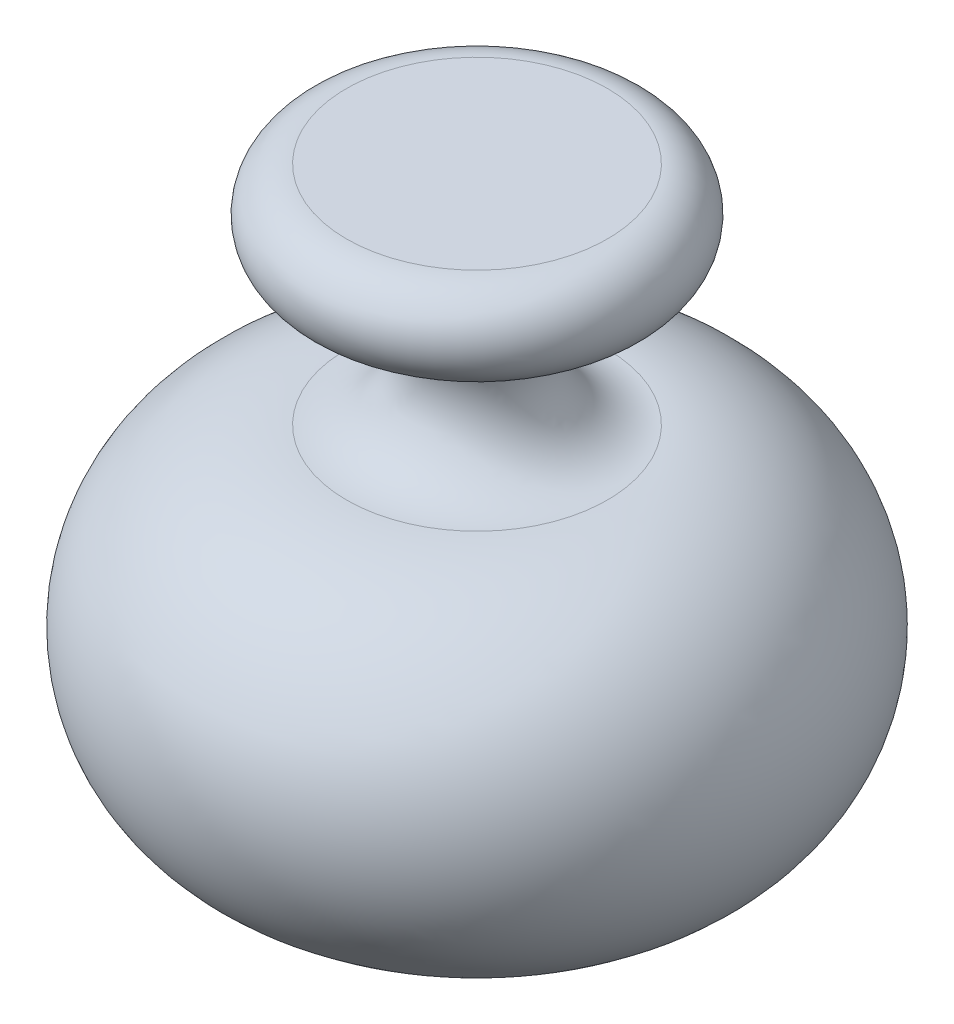
ISO-10303-21;
HEADER;
FILE_DESCRIPTION(('STEP AP214'),'2;1');
FILE_NAME('part.step','',(''),(''),'','','');
FILE_SCHEMA(('AUTOMOTIVE_DESIGN { 1 0 10303 214 1 1 1 1 }'));
ENDSEC;
DATA;
#1=APPLICATION_CONTEXT('core data for automotive mechanical design processes');
#2=APPLICATION_PROTOCOL_DEFINITION('international standard','automotive_design',2000,#1);
#3=PRODUCT_CONTEXT('',#1,'mechanical');
#4=PRODUCT('Part','Part','',(#3));
#5=PRODUCT_RELATED_PRODUCT_CATEGORY('part','',(#4));
#6=PRODUCT_DEFINITION_FORMATION('','',#4);
#7=PRODUCT_DEFINITION_CONTEXT('part definition',#1,'design');
#8=PRODUCT_DEFINITION('design','',#6,#7);
#9=PRODUCT_DEFINITION_SHAPE('','',#8);
#10=(LENGTH_UNIT() NAMED_UNIT(*) SI_UNIT(.MILLI.,.METRE.));
#11=(NAMED_UNIT(*) PLANE_ANGLE_UNIT() SI_UNIT($,.RADIAN.));
#12=(NAMED_UNIT(*) SI_UNIT($,.STERADIAN.) SOLID_ANGLE_UNIT());
#13=UNCERTAINTY_MEASURE_WITH_UNIT(LENGTH_MEASURE(1.E-05),#10,'distance_accuracy_value','');
#14=(GEOMETRIC_REPRESENTATION_CONTEXT(3) GLOBAL_UNCERTAINTY_ASSIGNED_CONTEXT((#13)) GLOBAL_UNIT_ASSIGNED_CONTEXT((#10,
#11,#12)) REPRESENTATION_CONTEXT('',''));
#15=CARTESIAN_POINT('',(0.,0.,0.));
#16=DIRECTION('',(0.,0.,1.));
#17=DIRECTION('',(1.,0.,0.));
#18=AXIS2_PLACEMENT_3D('',#15,#16,#17);
#19=CARTESIAN_POINT('',(0.,0.,0.));
#20=DIRECTION('',(0.,1.,0.));
#21=DIRECTION('',(0.,0.,1.));
#22=AXIS2_PLACEMENT_3D('',#19,#20,#21);
#23=PLANE('',#22);
#24=CARTESIAN_POINT('',(0.,0.,0.));
#25=DIRECTION('',(0.,1.,0.));
#26=DIRECTION('',(0.,0.,1.));
#27=AXIS2_PLACEMENT_3D('',#24,#25,#26);
#28=CIRCLE('',#27,15.);
#29=CARTESIAN_POINT('',(0.,0.,15.));
#30=VERTEX_POINT('',#29);
#31=EDGE_CURVE('E10',#30,#30,#28,.T.);
#32=ORIENTED_EDGE('',*,*,#31,.F.);
#33=EDGE_LOOP('',(#32));
#34=FACE_BOUND('',#33,.T.);
#35=ADVANCED_FACE('F33',(#34),#23,.F.);
#36=CARTESIAN_POINT('',(0.,20.,0.));
#37=DIRECTION('',(0.,1.,0.));
#38=DIRECTION('',(0.,0.,1.));
#39=AXIS2_PLACEMENT_3D('',#36,#37,#38);
#40=DEGENERATE_TOROIDAL_SURFACE('',#39,15.,20.,.T.);
#41=CARTESIAN_POINT('',(0.,40.,0.));
#42=DIRECTION('',(0.,1.,0.));
#43=DIRECTION('',(0.,0.,1.));
#44=AXIS2_PLACEMENT_3D('',#41,#42,#43);
#45=CIRCLE('',#44,15.);
#46=CARTESIAN_POINT('',(0.,40.,15.));
#47=VERTEX_POINT('',#46);
#48=EDGE_CURVE('E39',#47,#47,#45,.T.);
#49=ORIENTED_EDGE('',*,*,#48,.F.);
#50=EDGE_LOOP('',(#49));
#51=FACE_BOUND('',#50,.T.);
#52=ORIENTED_EDGE('',*,*,#31,.T.);
#53=EDGE_LOOP('',(#52));
#54=FACE_BOUND('',#53,.T.);
#55=ADVANCED_FACE('F63',(#51,#54),#40,.T.);
#56=CARTESIAN_POINT('',(0.,48.,0.));
#57=DIRECTION('',(0.,1.,0.));
#58=DIRECTION('',(0.,0.,1.));
#59=AXIS2_PLACEMENT_3D('',#56,#57,#58);
#60=TOROIDAL_SURFACE('',#59,15.,8.);
#61=CARTESIAN_POINT('',(0.,56.,0.));
#62=DIRECTION('',(0.,1.,0.));
#63=DIRECTION('',(0.,0.,1.));
#64=AXIS2_PLACEMENT_3D('',#61,#62,#63);
#65=CIRCLE('',#64,15.);
#66=CARTESIAN_POINT('',(0.,56.,15.));
#67=VERTEX_POINT('',#66);
#68=EDGE_CURVE('E43',#67,#67,#65,.T.);
#69=ORIENTED_EDGE('',*,*,#68,.F.);
#70=EDGE_LOOP('',(#69));
#71=FACE_BOUND('',#70,.T.);
#72=ORIENTED_EDGE('',*,*,#48,.T.);
#73=EDGE_LOOP('',(#72));
#74=FACE_BOUND('',#73,.T.);
#75=ADVANCED_FACE('F58',(#71,#74),#60,.F.);
#76=CARTESIAN_POINT('',(0.,61.,0.));
#77=DIRECTION('',(0.,1.,0.));
#78=DIRECTION('',(0.,0.,1.));
#79=AXIS2_PLACEMENT_3D('',#76,#77,#78);
#80=TOROIDAL_SURFACE('',#79,15.,5.);
#81=CARTESIAN_POINT('',(0.,66.,0.));
#82=DIRECTION('',(0.,1.,0.));
#83=DIRECTION('',(0.,0.,1.));
#84=AXIS2_PLACEMENT_3D('',#81,#82,#83);
#85=CIRCLE('',#84,15.);
#86=CARTESIAN_POINT('',(0.,66.,15.));
#87=VERTEX_POINT('',#86);
#88=EDGE_CURVE('E47',#87,#87,#85,.T.);
#89=ORIENTED_EDGE('',*,*,#88,.F.);
#90=EDGE_LOOP('',(#89));
#91=FACE_BOUND('',#90,.T.);
#92=ORIENTED_EDGE('',*,*,#68,.T.);
#93=EDGE_LOOP('',(#92));
#94=FACE_BOUND('',#93,.T.);
#95=ADVANCED_FACE('F55',(#91,#94),#80,.T.);
#96=CARTESIAN_POINT('',(15.,66.,0.));
#97=DIRECTION('',(0.,-1.,0.));
#98=DIRECTION('',(0.,0.,-1.));
#99=AXIS2_PLACEMENT_3D('',#96,#97,#98);
#100=PLANE('',#99);
#101=ORIENTED_EDGE('',*,*,#88,.T.);
#102=EDGE_LOOP('',(#101));
#103=FACE_BOUND('',#102,.T.);
#104=ADVANCED_FACE('F53',(#103),#100,.F.);
#105=CLOSED_SHELL('',(#35,#55,#75,#95,#104));
#106=MANIFOLD_SOLID_BREP('B2',#105);
#107=ADVANCED_BREP_SHAPE_REPRESENTATION('',(#18,#106),#14);
#108=SHAPE_DEFINITION_REPRESENTATION(#9,#107);
ENDSEC;
END-ISO-10303-21;
